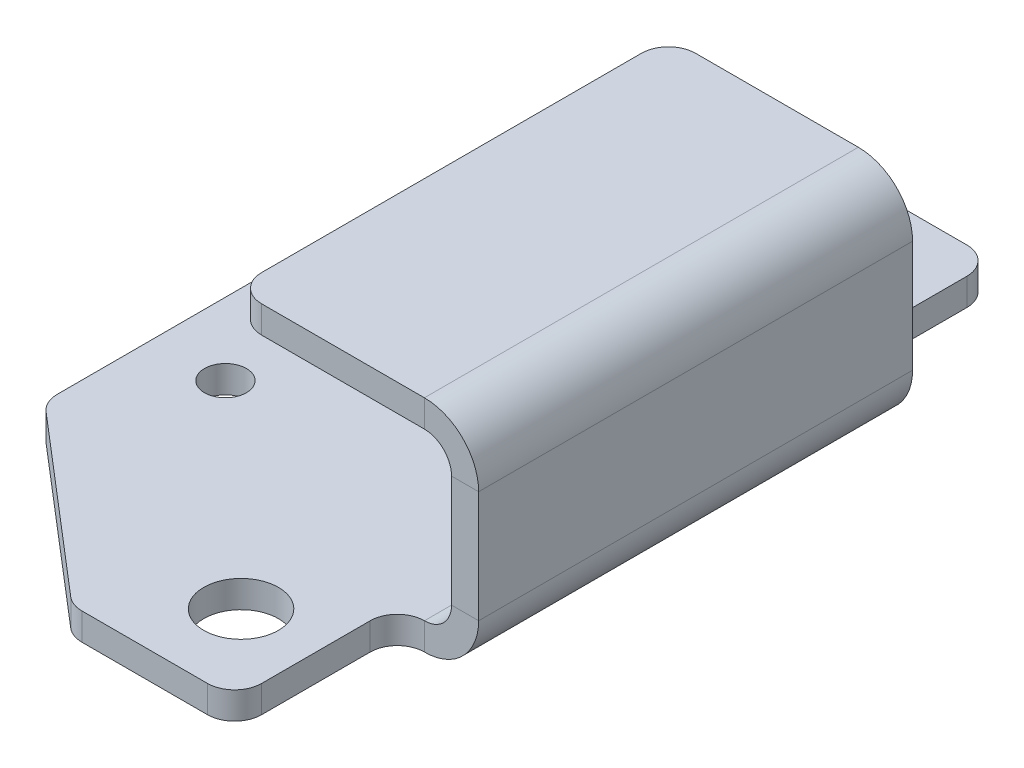
ISO-10303-21;
HEADER;
FILE_DESCRIPTION(('STEP AP214'),'2;1');
FILE_NAME('part.step','',(''),(''),'','','');
FILE_SCHEMA(('AUTOMOTIVE_DESIGN { 1 0 10303 214 1 1 1 1 }'));
ENDSEC;
DATA;
#1=APPLICATION_CONTEXT('core data for automotive mechanical design processes');
#2=APPLICATION_PROTOCOL_DEFINITION('international standard','automotive_design',2000,#1);
#3=PRODUCT_CONTEXT('',#1,'mechanical');
#4=PRODUCT('Part','Part','',(#3));
#5=PRODUCT_RELATED_PRODUCT_CATEGORY('part','',(#4));
#6=PRODUCT_DEFINITION_FORMATION('','',#4);
#7=PRODUCT_DEFINITION_CONTEXT('part definition',#1,'design');
#8=PRODUCT_DEFINITION('design','',#6,#7);
#9=PRODUCT_DEFINITION_SHAPE('','',#8);
#10=(LENGTH_UNIT() NAMED_UNIT(*) SI_UNIT(.MILLI.,.METRE.));
#11=(NAMED_UNIT(*) PLANE_ANGLE_UNIT() SI_UNIT($,.RADIAN.));
#12=(NAMED_UNIT(*) SI_UNIT($,.STERADIAN.) SOLID_ANGLE_UNIT());
#13=UNCERTAINTY_MEASURE_WITH_UNIT(LENGTH_MEASURE(1.E-05),#10,'distance_accuracy_value','');
#14=(GEOMETRIC_REPRESENTATION_CONTEXT(3) GLOBAL_UNCERTAINTY_ASSIGNED_CONTEXT((#13)) GLOBAL_UNIT_ASSIGNED_CONTEXT((#10,
#11,#12)) REPRESENTATION_CONTEXT('',''));
#15=CARTESIAN_POINT('',(0.,0.,0.));
#16=DIRECTION('',(0.,0.,1.));
#17=DIRECTION('',(1.,0.,0.));
#18=AXIS2_PLACEMENT_3D('',#15,#16,#17);
#19=CARTESIAN_POINT('',(25.4,-19.431,25.4));
#20=DIRECTION('',(0.,-1.,0.));
#21=DIRECTION('',(1.,0.,0.));
#22=AXIS2_PLACEMENT_3D('',#19,#20,#21);
#23=PLANE('',#22);
#24=CARTESIAN_POINT('',(-13.7668,-19.431,12.7));
#25=DIRECTION('',(0.,1.,0.));
#26=DIRECTION('',(-1.,0.,0.));
#27=AXIS2_PLACEMENT_3D('',#24,#25,#26);
#28=CIRCLE('',#27,2.45745);
#29=CARTESIAN_POINT('',(-16.22425,-19.431,12.7));
#30=VERTEX_POINT('',#29);
#31=EDGE_CURVE('E840',#30,#30,#28,.T.);
#32=ORIENTED_EDGE('',*,*,#31,.F.);
#33=EDGE_LOOP('',(#32));
#34=FACE_BOUND('',#33,.T.);
#35=CARTESIAN_POINT('',(-13.7668,-19.431,-12.7));
#36=DIRECTION('',(0.,1.,0.));
#37=DIRECTION('',(-1.,0.,0.));
#38=AXIS2_PLACEMENT_3D('',#35,#36,#37);
#39=CIRCLE('',#38,2.45745);
#40=CARTESIAN_POINT('',(-16.22425,-19.431,-12.7));
#41=VERTEX_POINT('',#40);
#42=EDGE_CURVE('E841',#41,#41,#39,.T.);
#43=ORIENTED_EDGE('',*,*,#42,.F.);
#44=EDGE_LOOP('',(#43));
#45=FACE_BOUND('',#44,.T.);
#46=CARTESIAN_POINT('',(10.287,-19.431,34.925));
#47=DIRECTION('',(0.,1.,0.));
#48=DIRECTION('',(-1.,0.,0.));
#49=AXIS2_PLACEMENT_3D('',#46,#47,#48);
#50=CIRCLE('',#49,4.36880000000001);
#51=CARTESIAN_POINT('',(5.9182,-19.431,34.925));
#52=VERTEX_POINT('',#51);
#53=EDGE_CURVE('E847',#52,#52,#50,.T.);
#54=ORIENTED_EDGE('',*,*,#53,.F.);
#55=EDGE_LOOP('',(#54));
#56=FACE_BOUND('',#55,.T.);
#57=CARTESIAN_POINT('',(10.287,-19.431,-34.925));
#58=DIRECTION('',(0.,1.,0.));
#59=DIRECTION('',(-1.,0.,0.));
#60=AXIS2_PLACEMENT_3D('',#57,#58,#59);
#61=CIRCLE('',#60,4.36879999999999);
#62=CARTESIAN_POINT('',(5.91820000000002,-19.431,-34.925));
#63=VERTEX_POINT('',#62);
#64=EDGE_CURVE('E853',#63,#63,#61,.T.);
#65=ORIENTED_EDGE('',*,*,#64,.F.);
#66=EDGE_LOOP('',(#65));
#67=FACE_BOUND('',#66,.T.);
#68=DIRECTION('',(0.759256602365297,0.,0.650791373455969));
#69=VECTOR('',#68,1.);
#70=CARTESIAN_POINT('',(-21.9635294117647,-19.431,25.6241176470588));
#71=LINE('',#70,#69);
#72=CARTESIAN_POINT('',(-21.1162626107227,-19.431,26.3503463336663));
#73=VERTEX_POINT('',#72);
#74=CARTESIAN_POINT('',(-0.891753668738532,-19.431,43.6856397125098));
#75=VERTEX_POINT('',#74);
#76=EDGE_CURVE('E833',#73,#75,#71,.T.);
#77=ORIENTED_EDGE('',*,*,#76,.T.);
#78=CARTESIAN_POINT('',(1.17450894198416,-19.431,41.275));
#79=DIRECTION('',(0.,-1.,0.));
#80=DIRECTION('',(1.,0.,0.));
#81=AXIS2_PLACEMENT_3D('',#78,#79,#80);
#82=CIRCLE('',#81,3.175);
#83=CARTESIAN_POINT('',(1.17450894198416,-19.431,44.45));
#84=VERTEX_POINT('',#83);
#85=EDGE_CURVE('E355',#75,#84,#82,.F.);
#86=ORIENTED_EDGE('',*,*,#85,.T.);
#87=DIRECTION('',(-1.,0.,0.));
#88=VECTOR('',#87,1.);
#89=CARTESIAN_POINT('',(-22.225,-19.431,44.45));
#90=LINE('',#89,#88);
#91=CARTESIAN_POINT('',(15.875,-19.431,44.45));
#92=VERTEX_POINT('',#91);
#93=EDGE_CURVE('E283',#92,#84,#90,.T.);
#94=ORIENTED_EDGE('',*,*,#93,.F.);
#95=CARTESIAN_POINT('',(15.875,-19.431,41.275));
#96=DIRECTION('',(0.,-1.,0.));
#97=DIRECTION('',(1.,0.,0.));
#98=AXIS2_PLACEMENT_3D('',#95,#96,#97);
#99=CIRCLE('',#98,3.175);
#100=CARTESIAN_POINT('',(19.05,-19.431,41.275));
#101=VERTEX_POINT('',#100);
#102=EDGE_CURVE('E345',#92,#101,#99,.F.);
#103=ORIENTED_EDGE('',*,*,#102,.T.);
#104=DIRECTION('',(0.,0.,1.));
#105=VECTOR('',#104,1.);
#106=CARTESIAN_POINT('',(19.05,-19.431,25.4));
#107=LINE('',#106,#105);
#108=CARTESIAN_POINT('',(19.05,-19.431,28.575));
#109=VERTEX_POINT('',#108);
#110=EDGE_CURVE('E863',#109,#101,#107,.T.);
#111=ORIENTED_EDGE('',*,*,#110,.F.);
#112=CARTESIAN_POINT('',(22.225,-19.431,28.575));
#113=DIRECTION('',(0.,-1.,0.));
#114=DIRECTION('',(1.,0.,0.));
#115=AXIS2_PLACEMENT_3D('',#112,#113,#114);
#116=CIRCLE('',#115,3.175);
#117=CARTESIAN_POINT('',(22.225,-19.431,25.4));
#118=VERTEX_POINT('',#117);
#119=EDGE_CURVE('E11',#109,#118,#116,.T.);
#120=ORIENTED_EDGE('',*,*,#119,.T.);
#121=DIRECTION('',(0.,0.,-1.));
#122=VECTOR('',#121,1.);
#123=CARTESIAN_POINT('',(22.225,-19.431,25.4));
#124=LINE('',#123,#122);
#125=CARTESIAN_POINT('',(22.225,-19.431,-25.4));
#126=VERTEX_POINT('',#125);
#127=EDGE_CURVE('E279',#118,#126,#124,.T.);
#128=ORIENTED_EDGE('',*,*,#127,.T.);
#129=CARTESIAN_POINT('',(22.225,-19.431,-28.575));
#130=DIRECTION('',(0.,-1.,0.));
#131=DIRECTION('',(1.,0.,0.));
#132=AXIS2_PLACEMENT_3D('',#129,#130,#131);
#133=CIRCLE('',#132,3.175);
#134=CARTESIAN_POINT('',(19.05,-19.431,-28.575));
#135=VERTEX_POINT('',#134);
#136=EDGE_CURVE('E225',#126,#135,#133,.T.);
#137=ORIENTED_EDGE('',*,*,#136,.T.);
#138=DIRECTION('',(0.,0.,1.));
#139=VECTOR('',#138,1.);
#140=CARTESIAN_POINT('',(19.05,-19.431,-25.4));
#141=LINE('',#140,#139);
#142=CARTESIAN_POINT('',(19.05,-19.431,-41.275));
#143=VERTEX_POINT('',#142);
#144=EDGE_CURVE('E420',#143,#135,#141,.T.);
#145=ORIENTED_EDGE('',*,*,#144,.F.);
#146=CARTESIAN_POINT('',(15.875,-19.431,-41.275));
#147=DIRECTION('',(0.,-1.,0.));
#148=DIRECTION('',(1.,0.,0.));
#149=AXIS2_PLACEMENT_3D('',#146,#147,#148);
#150=CIRCLE('',#149,3.175);
#151=CARTESIAN_POINT('',(15.875,-19.431,-44.45));
#152=VERTEX_POINT('',#151);
#153=EDGE_CURVE('E347',#143,#152,#150,.F.);
#154=ORIENTED_EDGE('',*,*,#153,.T.);
#155=DIRECTION('',(1.,0.,0.));
#156=VECTOR('',#155,1.);
#157=CARTESIAN_POINT('',(-22.225,-19.431,-44.45));
#158=LINE('',#157,#156);
#159=CARTESIAN_POINT('',(1.17450894198416,-19.431,-44.45));
#160=VERTEX_POINT('',#159);
#161=EDGE_CURVE('E429',#160,#152,#158,.T.);
#162=ORIENTED_EDGE('',*,*,#161,.F.);
#163=CARTESIAN_POINT('',(1.17450894198416,-19.431,-41.275));
#164=DIRECTION('',(0.,-1.,0.));
#165=DIRECTION('',(1.,0.,0.));
#166=AXIS2_PLACEMENT_3D('',#163,#164,#165);
#167=CIRCLE('',#166,3.175);
#168=CARTESIAN_POINT('',(-0.891753668738532,-19.431,-43.6856397125098));
#169=VERTEX_POINT('',#168);
#170=EDGE_CURVE('E351',#160,#169,#167,.F.);
#171=ORIENTED_EDGE('',*,*,#170,.T.);
#172=DIRECTION('',(0.759256602365297,0.,-0.650791373455969));
#173=VECTOR('',#172,1.);
#174=CARTESIAN_POINT('',(-21.9635294117647,-19.431,-25.6241176470588));
#175=LINE('',#174,#173);
#176=CARTESIAN_POINT('',(-21.1162626107227,-19.431,-26.3503463336663));
#177=VERTEX_POINT('',#176);
#178=EDGE_CURVE('E827',#177,#169,#175,.T.);
#179=ORIENTED_EDGE('',*,*,#178,.F.);
#180=CARTESIAN_POINT('',(-19.05,-19.431,-23.9397066211564));
#181=DIRECTION('',(0.,-1.,0.));
#182=DIRECTION('',(1.,0.,0.));
#183=AXIS2_PLACEMENT_3D('',#180,#181,#182);
#184=CIRCLE('',#183,3.175);
#185=CARTESIAN_POINT('',(-22.225,-19.431,-23.9397066211564));
#186=VERTEX_POINT('',#185);
#187=EDGE_CURVE('E349',#177,#186,#184,.F.);
#188=ORIENTED_EDGE('',*,*,#187,.T.);
#189=DIRECTION('',(0.,0.,-1.));
#190=VECTOR('',#189,1.);
#191=CARTESIAN_POINT('',(-22.225,-19.431,25.4));
#192=LINE('',#191,#190);
#193=CARTESIAN_POINT('',(-22.225,-19.431,23.9397066211564));
#194=VERTEX_POINT('',#193);
#195=EDGE_CURVE('E322',#194,#186,#192,.T.);
#196=ORIENTED_EDGE('',*,*,#195,.F.);
#197=CARTESIAN_POINT('',(-19.05,-19.431,23.9397066211564));
#198=DIRECTION('',(0.,-1.,0.));
#199=DIRECTION('',(1.,0.,0.));
#200=AXIS2_PLACEMENT_3D('',#197,#198,#199);
#201=CIRCLE('',#200,3.175);
#202=EDGE_CURVE('E353',#194,#73,#201,.F.);
#203=ORIENTED_EDGE('',*,*,#202,.T.);
#204=EDGE_LOOP('',(#77,#86,#94,#103,#111,#120,#128,#137,#145,#154,#162,#171,#179,#188,#196,#203));
#205=FACE_BOUND('',#204,.T.);
#206=ADVANCED_FACE('F41',(#34,#45,#56,#67,#205),#23,.F.);
#207=CARTESIAN_POINT('',(-22.225,-22.606,25.4));
#208=DIRECTION('',(-1.,0.,0.));
#209=DIRECTION('',(0.,0.,1.));
#210=AXIS2_PLACEMENT_3D('',#207,#208,#209);
#211=PLANE('',#210);
#212=DIRECTION('',(0.,0.,-1.));
#213=VECTOR('',#212,1.);
#214=CARTESIAN_POINT('',(-22.225,-22.606,25.4));
#215=LINE('',#214,#213);
#216=CARTESIAN_POINT('',(-22.225,-22.606,23.9397066211564));
#217=VERTEX_POINT('',#216);
#218=CARTESIAN_POINT('',(-22.225,-22.606,-23.9397066211564));
#219=VERTEX_POINT('',#218);
#220=EDGE_CURVE('E248',#217,#219,#215,.T.);
#221=ORIENTED_EDGE('',*,*,#220,.F.);
#222=DIRECTION('',(0.,1.,0.));
#223=VECTOR('',#222,1.);
#224=CARTESIAN_POINT('',(-22.225,-22.606,23.9397066211564));
#225=LINE('',#224,#223);
#226=EDGE_CURVE('E375',#217,#194,#225,.T.);
#227=ORIENTED_EDGE('',*,*,#226,.T.);
#228=ORIENTED_EDGE('',*,*,#195,.T.);
#229=DIRECTION('',(0.,1.,0.));
#230=VECTOR('',#229,1.);
#231=CARTESIAN_POINT('',(-22.225,-22.606,-23.9397066211564));
#232=LINE('',#231,#230);
#233=EDGE_CURVE('E373',#186,#219,#232,.F.);
#234=ORIENTED_EDGE('',*,*,#233,.T.);
#235=EDGE_LOOP('',(#221,#227,#228,#234));
#236=FACE_BOUND('',#235,.T.);
#237=ADVANCED_FACE('F497',(#236),#211,.T.);
#238=CARTESIAN_POINT('',(25.4,-22.606,25.4));
#239=DIRECTION('',(0.,-1.,0.));
#240=DIRECTION('',(1.,0.,0.));
#241=AXIS2_PLACEMENT_3D('',#238,#239,#240);
#242=PLANE('',#241);
#243=CARTESIAN_POINT('',(10.287,-22.606,-34.925));
#244=DIRECTION('',(0.,1.,0.));
#245=DIRECTION('',(-1.,0.,0.));
#246=AXIS2_PLACEMENT_3D('',#243,#244,#245);
#247=CIRCLE('',#246,4.36879999999999);
#248=CARTESIAN_POINT('',(5.91820000000002,-22.606,-34.925));
#249=VERTEX_POINT('',#248);
#250=EDGE_CURVE('E850',#249,#249,#247,.T.);
#251=ORIENTED_EDGE('',*,*,#250,.T.);
#252=EDGE_LOOP('',(#251));
#253=FACE_BOUND('',#252,.T.);
#254=CARTESIAN_POINT('',(10.287,-22.606,34.925));
#255=DIRECTION('',(0.,1.,0.));
#256=DIRECTION('',(-1.,0.,0.));
#257=AXIS2_PLACEMENT_3D('',#254,#255,#256);
#258=CIRCLE('',#257,4.36880000000001);
#259=CARTESIAN_POINT('',(5.9182,-22.606,34.925));
#260=VERTEX_POINT('',#259);
#261=EDGE_CURVE('E844',#260,#260,#258,.T.);
#262=ORIENTED_EDGE('',*,*,#261,.T.);
#263=EDGE_LOOP('',(#262));
#264=FACE_BOUND('',#263,.T.);
#265=CARTESIAN_POINT('',(-13.7668,-22.606,-12.7));
#266=DIRECTION('',(0.,1.,0.));
#267=DIRECTION('',(-1.,0.,0.));
#268=AXIS2_PLACEMENT_3D('',#265,#266,#267);
#269=CIRCLE('',#268,2.45745);
#270=CARTESIAN_POINT('',(-16.22425,-22.606,-12.7));
#271=VERTEX_POINT('',#270);
#272=EDGE_CURVE('E837',#271,#271,#269,.T.);
#273=ORIENTED_EDGE('',*,*,#272,.T.);
#274=EDGE_LOOP('',(#273));
#275=FACE_BOUND('',#274,.T.);
#276=CARTESIAN_POINT('',(-13.7668,-22.606,12.7));
#277=DIRECTION('',(0.,1.,0.));
#278=DIRECTION('',(-1.,0.,0.));
#279=AXIS2_PLACEMENT_3D('',#276,#277,#278);
#280=CIRCLE('',#279,2.45745);
#281=CARTESIAN_POINT('',(-16.22425,-22.606,12.7));
#282=VERTEX_POINT('',#281);
#283=EDGE_CURVE('E821',#282,#282,#280,.T.);
#284=ORIENTED_EDGE('',*,*,#283,.T.);
#285=EDGE_LOOP('',(#284));
#286=FACE_BOUND('',#285,.T.);
#287=DIRECTION('',(-1.,0.,0.));
#288=VECTOR('',#287,1.);
#289=CARTESIAN_POINT('',(-22.225,-22.606,44.45));
#290=LINE('',#289,#288);
#291=CARTESIAN_POINT('',(15.875,-22.606,44.45));
#292=VERTEX_POINT('',#291);
#293=CARTESIAN_POINT('',(1.17450894198416,-22.606,44.45));
#294=VERTEX_POINT('',#293);
#295=EDGE_CURVE('E263',#292,#294,#290,.T.);
#296=ORIENTED_EDGE('',*,*,#295,.T.);
#297=CARTESIAN_POINT('',(1.17450894198416,-22.606,41.275));
#298=DIRECTION('',(0.,-1.,0.));
#299=DIRECTION('',(1.,0.,0.));
#300=AXIS2_PLACEMENT_3D('',#297,#298,#299);
#301=CIRCLE('',#300,3.175);
#302=CARTESIAN_POINT('',(-0.891753668738532,-22.606,43.6856397125098));
#303=VERTEX_POINT('',#302);
#304=EDGE_CURVE('E371',#294,#303,#301,.T.);
#305=ORIENTED_EDGE('',*,*,#304,.T.);
#306=DIRECTION('',(0.759256602365297,0.,0.650791373455969));
#307=VECTOR('',#306,1.);
#308=CARTESIAN_POINT('',(-21.9635294117647,-22.606,25.6241176470588));
#309=LINE('',#308,#307);
#310=CARTESIAN_POINT('',(-21.1162626107227,-22.606,26.3503463336663));
#311=VERTEX_POINT('',#310);
#312=EDGE_CURVE('E856',#311,#303,#309,.T.);
#313=ORIENTED_EDGE('',*,*,#312,.F.);
#314=CARTESIAN_POINT('',(-19.05,-22.606,23.9397066211564));
#315=DIRECTION('',(0.,-1.,0.));
#316=DIRECTION('',(1.,0.,0.));
#317=AXIS2_PLACEMENT_3D('',#314,#315,#316);
#318=CIRCLE('',#317,3.175);
#319=EDGE_CURVE('E369',#311,#217,#318,.T.);
#320=ORIENTED_EDGE('',*,*,#319,.T.);
#321=ORIENTED_EDGE('',*,*,#220,.T.);
#322=CARTESIAN_POINT('',(-19.05,-22.606,-23.9397066211564));
#323=DIRECTION('',(0.,-1.,0.));
#324=DIRECTION('',(1.,0.,0.));
#325=AXIS2_PLACEMENT_3D('',#322,#323,#324);
#326=CIRCLE('',#325,3.175);
#327=CARTESIAN_POINT('',(-21.1162626107227,-22.606,-26.3503463336663));
#328=VERTEX_POINT('',#327);
#329=EDGE_CURVE('E365',#219,#328,#326,.T.);
#330=ORIENTED_EDGE('',*,*,#329,.T.);
#331=DIRECTION('',(0.759256602365297,0.,-0.650791373455969));
#332=VECTOR('',#331,1.);
#333=CARTESIAN_POINT('',(-21.9635294117647,-22.606,-25.6241176470588));
#334=LINE('',#333,#332);
#335=CARTESIAN_POINT('',(-0.891753668738532,-22.606,-43.6856397125098));
#336=VERTEX_POINT('',#335);
#337=EDGE_CURVE('E831',#328,#336,#334,.T.);
#338=ORIENTED_EDGE('',*,*,#337,.T.);
#339=CARTESIAN_POINT('',(1.17450894198416,-22.606,-41.275));
#340=DIRECTION('',(0.,-1.,0.));
#341=DIRECTION('',(1.,0.,0.));
#342=AXIS2_PLACEMENT_3D('',#339,#340,#341);
#343=CIRCLE('',#342,3.175);
#344=CARTESIAN_POINT('',(1.17450894198416,-22.606,-44.45));
#345=VERTEX_POINT('',#344);
#346=EDGE_CURVE('E367',#336,#345,#343,.T.);
#347=ORIENTED_EDGE('',*,*,#346,.T.);
#348=DIRECTION('',(1.,0.,0.));
#349=VECTOR('',#348,1.);
#350=CARTESIAN_POINT('',(-22.225,-22.606,-44.45));
#351=LINE('',#350,#349);
#352=CARTESIAN_POINT('',(15.875,-22.606,-44.45));
#353=VERTEX_POINT('',#352);
#354=EDGE_CURVE('E815',#345,#353,#351,.T.);
#355=ORIENTED_EDGE('',*,*,#354,.T.);
#356=CARTESIAN_POINT('',(15.875,-22.606,-41.275));
#357=DIRECTION('',(0.,-1.,0.));
#358=DIRECTION('',(1.,0.,0.));
#359=AXIS2_PLACEMENT_3D('',#356,#357,#358);
#360=CIRCLE('',#359,3.175);
#361=CARTESIAN_POINT('',(19.05,-22.606,-41.275));
#362=VERTEX_POINT('',#361);
#363=EDGE_CURVE('E363',#353,#362,#360,.T.);
#364=ORIENTED_EDGE('',*,*,#363,.T.);
#365=DIRECTION('',(0.,0.,1.));
#366=VECTOR('',#365,1.);
#367=CARTESIAN_POINT('',(19.05,-22.606,-25.4));
#368=LINE('',#367,#366);
#369=CARTESIAN_POINT('',(19.05,-22.606,-28.575));
#370=VERTEX_POINT('',#369);
#371=EDGE_CURVE('E820',#362,#370,#368,.T.);
#372=ORIENTED_EDGE('',*,*,#371,.T.);
#373=CARTESIAN_POINT('',(22.225,-22.606,-28.575));
#374=DIRECTION('',(0.,-1.,0.));
#375=DIRECTION('',(1.,0.,0.));
#376=AXIS2_PLACEMENT_3D('',#373,#374,#375);
#377=CIRCLE('',#376,3.175);
#378=CARTESIAN_POINT('',(22.225,-22.606,-25.4));
#379=VERTEX_POINT('',#378);
#380=EDGE_CURVE('E244',#370,#379,#377,.F.);
#381=ORIENTED_EDGE('',*,*,#380,.T.);
#382=DIRECTION('',(0.,0.,-1.));
#383=VECTOR('',#382,1.);
#384=CARTESIAN_POINT('',(22.225,-22.606,25.4));
#385=LINE('',#384,#383);
#386=CARTESIAN_POINT('',(22.225,-22.606,25.4));
#387=VERTEX_POINT('',#386);
#388=EDGE_CURVE('E240',#387,#379,#385,.T.);
#389=ORIENTED_EDGE('',*,*,#388,.F.);
#390=CARTESIAN_POINT('',(22.225,-22.606,28.575));
#391=DIRECTION('',(0.,-1.,0.));
#392=DIRECTION('',(1.,0.,0.));
#393=AXIS2_PLACEMENT_3D('',#390,#391,#392);
#394=CIRCLE('',#393,3.175);
#395=CARTESIAN_POINT('',(19.05,-22.606,28.575));
#396=VERTEX_POINT('',#395);
#397=EDGE_CURVE('E49',#387,#396,#394,.F.);
#398=ORIENTED_EDGE('',*,*,#397,.T.);
#399=DIRECTION('',(0.,0.,1.));
#400=VECTOR('',#399,1.);
#401=CARTESIAN_POINT('',(19.05,-22.606,25.4));
#402=LINE('',#401,#400);
#403=CARTESIAN_POINT('',(19.05,-22.606,41.275));
#404=VERTEX_POINT('',#403);
#405=EDGE_CURVE('E428',#396,#404,#402,.T.);
#406=ORIENTED_EDGE('',*,*,#405,.T.);
#407=CARTESIAN_POINT('',(15.875,-22.606,41.275));
#408=DIRECTION('',(0.,-1.,0.));
#409=DIRECTION('',(1.,0.,0.));
#410=AXIS2_PLACEMENT_3D('',#407,#408,#409);
#411=CIRCLE('',#410,3.175);
#412=EDGE_CURVE('E361',#404,#292,#411,.T.);
#413=ORIENTED_EDGE('',*,*,#412,.T.);
#414=EDGE_LOOP('',(#296,#305,#313,#320,#321,#330,#338,#347,#355,#364,#372,#381,#389,#398,#406,#413));
#415=FACE_BOUND('',#414,.T.);
#416=ADVANCED_FACE('F242',(#253,#264,#275,#286,#415),#242,.T.);
#417=CARTESIAN_POINT('',(-22.225,-19.431,44.45));
#418=DIRECTION('',(0.,0.,1.));
#419=DIRECTION('',(1.,0.,0.));
#420=AXIS2_PLACEMENT_3D('',#417,#418,#419);
#421=PLANE('',#420);
#422=ORIENTED_EDGE('',*,*,#93,.T.);
#423=DIRECTION('',(0.,1.,0.));
#424=VECTOR('',#423,1.);
#425=CARTESIAN_POINT('',(1.17450894198416,-19.431,44.45));
#426=LINE('',#425,#424);
#427=EDGE_CURVE('E359',#84,#294,#426,.F.);
#428=ORIENTED_EDGE('',*,*,#427,.T.);
#429=ORIENTED_EDGE('',*,*,#295,.F.);
#430=DIRECTION('',(0.,-1.,0.));
#431=VECTOR('',#430,1.);
#432=CARTESIAN_POINT('',(15.875,-19.431,44.45));
#433=LINE('',#432,#431);
#434=EDGE_CURVE('E357',#292,#92,#433,.F.);
#435=ORIENTED_EDGE('',*,*,#434,.T.);
#436=EDGE_LOOP('',(#422,#428,#429,#435));
#437=FACE_BOUND('',#436,.T.);
#438=ADVANCED_FACE('F524',(#437),#421,.T.);
#439=CARTESIAN_POINT('',(22.225,0.,25.4));
#440=DIRECTION('',(0.,0.,1.));
#441=DIRECTION('',(1.,0.,0.));
#442=AXIS2_PLACEMENT_3D('',#439,#440,#441);
#443=PLANE('',#442);
#444=DIRECTION('',(0.,1.,0.));
#445=VECTOR('',#444,1.);
#446=CARTESIAN_POINT('',(22.225,0.,25.4));
#447=LINE('',#446,#445);
#448=CARTESIAN_POINT('',(22.225,0.,25.4));
#449=VERTEX_POINT('',#448);
#450=CARTESIAN_POINT('',(22.225,3.175,25.4));
#451=VERTEX_POINT('',#450);
#452=EDGE_CURVE('E337',#449,#451,#447,.T.);
#453=ORIENTED_EDGE('',*,*,#452,.F.);
#454=CARTESIAN_POINT('',(22.225,-3.175,25.4));
#455=DIRECTION('',(0.,0.,1.));
#456=DIRECTION('',(1.,0.,0.));
#457=AXIS2_PLACEMENT_3D('',#454,#455,#456);
#458=CIRCLE('',#457,3.175);
#459=CARTESIAN_POINT('',(25.4,-3.175,25.4));
#460=VERTEX_POINT('',#459);
#461=EDGE_CURVE('E272',#449,#460,#458,.F.);
#462=ORIENTED_EDGE('',*,*,#461,.T.);
#463=DIRECTION('',(-1.,0.,0.));
#464=VECTOR('',#463,1.);
#465=CARTESIAN_POINT('',(28.575,-3.175,25.4));
#466=LINE('',#465,#464);
#467=CARTESIAN_POINT('',(28.575,-3.175,25.4));
#468=VERTEX_POINT('',#467);
#469=EDGE_CURVE('E335',#468,#460,#466,.T.);
#470=ORIENTED_EDGE('',*,*,#469,.F.);
#471=CARTESIAN_POINT('',(22.225,-3.175,25.4));
#472=DIRECTION('',(0.,0.,1.));
#473=DIRECTION('',(1.,0.,0.));
#474=AXIS2_PLACEMENT_3D('',#471,#472,#473);
#475=CIRCLE('',#474,6.35);
#476=EDGE_CURVE('E257',#451,#468,#475,.F.);
#477=ORIENTED_EDGE('',*,*,#476,.F.);
#478=EDGE_LOOP('',(#453,#462,#470,#477));
#479=FACE_BOUND('',#478,.T.);
#480=ADVANCED_FACE('F459',(#479),#443,.T.);
#481=CARTESIAN_POINT('',(28.575,-3.175,25.4));
#482=DIRECTION('',(0.,0.,1.));
#483=DIRECTION('',(1.,0.,0.));
#484=AXIS2_PLACEMENT_3D('',#481,#482,#483);
#485=PLANE('',#484);
#486=DIRECTION('',(1.,0.,0.));
#487=VECTOR('',#486,1.);
#488=CARTESIAN_POINT('',(0.,3.175,25.4));
#489=LINE('',#488,#487);
#490=CARTESIAN_POINT('',(3.175,3.175,25.4));
#491=VERTEX_POINT('',#490);
#492=EDGE_CURVE('E268',#491,#451,#489,.T.);
#493=ORIENTED_EDGE('',*,*,#492,.F.);
#494=DIRECTION('',(0.,1.,0.));
#495=VECTOR('',#494,1.);
#496=CARTESIAN_POINT('',(3.175,-3.175,25.4));
#497=LINE('',#496,#495);
#498=CARTESIAN_POINT('',(3.175,0.,25.4));
#499=VERTEX_POINT('',#498);
#500=EDGE_CURVE('E56',#491,#499,#497,.F.);
#501=ORIENTED_EDGE('',*,*,#500,.T.);
#502=DIRECTION('',(1.,0.,0.));
#503=VECTOR('',#502,1.);
#504=CARTESIAN_POINT('',(0.,0.,25.4));
#505=LINE('',#504,#503);
#506=EDGE_CURVE('E270',#499,#449,#505,.T.);
#507=ORIENTED_EDGE('',*,*,#506,.T.);
#508=ORIENTED_EDGE('',*,*,#452,.T.);
#509=EDGE_LOOP('',(#493,#501,#507,#508));
#510=FACE_BOUND('',#509,.T.);
#511=ADVANCED_FACE('F474',(#510),#485,.T.);
#512=CARTESIAN_POINT('',(25.4,-3.175,-25.4));
#513=DIRECTION('',(0.,0.,-1.));
#514=DIRECTION('',(-1.,0.,0.));
#515=AXIS2_PLACEMENT_3D('',#512,#513,#514);
#516=PLANE('',#515);
#517=DIRECTION('',(1.,0.,0.));
#518=VECTOR('',#517,1.);
#519=CARTESIAN_POINT('',(25.4,-3.175,-25.4));
#520=LINE('',#519,#518);
#521=CARTESIAN_POINT('',(25.4,-3.175,-25.4));
#522=VERTEX_POINT('',#521);
#523=CARTESIAN_POINT('',(28.575,-3.175,-25.4));
#524=VERTEX_POINT('',#523);
#525=EDGE_CURVE('E333',#522,#524,#520,.T.);
#526=ORIENTED_EDGE('',*,*,#525,.F.);
#527=CARTESIAN_POINT('',(22.225,-3.175,-25.4));
#528=DIRECTION('',(0.,0.,1.));
#529=DIRECTION('',(1.,0.,0.));
#530=AXIS2_PLACEMENT_3D('',#527,#528,#529);
#531=CIRCLE('',#530,3.175);
#532=CARTESIAN_POINT('',(22.225,0.,-25.4));
#533=VERTEX_POINT('',#532);
#534=EDGE_CURVE('E293',#533,#522,#531,.F.);
#535=ORIENTED_EDGE('',*,*,#534,.F.);
#536=DIRECTION('',(0.,-1.,0.));
#537=VECTOR('',#536,1.);
#538=CARTESIAN_POINT('',(22.225,3.175,-25.4));
#539=LINE('',#538,#537);
#540=CARTESIAN_POINT('',(22.225,3.175,-25.4));
#541=VERTEX_POINT('',#540);
#542=EDGE_CURVE('E330',#541,#533,#539,.T.);
#543=ORIENTED_EDGE('',*,*,#542,.F.);
#544=CARTESIAN_POINT('',(22.225,-3.175,-25.4));
#545=DIRECTION('',(0.,0.,1.));
#546=DIRECTION('',(1.,0.,0.));
#547=AXIS2_PLACEMENT_3D('',#544,#545,#546);
#548=CIRCLE('',#547,6.35);
#549=EDGE_CURVE('E286',#541,#524,#548,.F.);
#550=ORIENTED_EDGE('',*,*,#549,.T.);
#551=EDGE_LOOP('',(#526,#535,#543,#550));
#552=FACE_BOUND('',#551,.T.);
#553=ADVANCED_FACE('F467',(#552),#516,.T.);
#554=CARTESIAN_POINT('',(22.225,3.175,-25.4));
#555=DIRECTION('',(0.,0.,-1.));
#556=DIRECTION('',(-1.,0.,0.));
#557=AXIS2_PLACEMENT_3D('',#554,#555,#556);
#558=PLANE('',#557);
#559=DIRECTION('',(0.,-1.,0.));
#560=VECTOR('',#559,1.);
#561=CARTESIAN_POINT('',(25.4,0.,-25.4));
#562=LINE('',#561,#560);
#563=CARTESIAN_POINT('',(25.4,-16.256,-25.4));
#564=VERTEX_POINT('',#563);
#565=EDGE_CURVE('E260',#522,#564,#562,.T.);
#566=ORIENTED_EDGE('',*,*,#565,.F.);
#567=ORIENTED_EDGE('',*,*,#525,.T.);
#568=DIRECTION('',(0.,-1.,0.));
#569=VECTOR('',#568,1.);
#570=CARTESIAN_POINT('',(28.575,0.,-25.4));
#571=LINE('',#570,#569);
#572=CARTESIAN_POINT('',(28.575,-16.256,-25.4));
#573=VERTEX_POINT('',#572);
#574=EDGE_CURVE('E282',#524,#573,#571,.T.);
#575=ORIENTED_EDGE('',*,*,#574,.T.);
#576=DIRECTION('',(-1.,0.,0.));
#577=VECTOR('',#576,1.);
#578=CARTESIAN_POINT('',(28.575,-16.256,-25.4));
#579=LINE('',#578,#577);
#580=EDGE_CURVE('E325',#573,#564,#579,.T.);
#581=ORIENTED_EDGE('',*,*,#580,.T.);
#582=EDGE_LOOP('',(#566,#567,#575,#581));
#583=FACE_BOUND('',#582,.T.);
#584=ADVANCED_FACE('F444',(#583),#558,.T.);
#585=CARTESIAN_POINT('',(25.4,-16.256,25.4));
#586=DIRECTION('',(0.,0.,1.));
#587=DIRECTION('',(1.,0.,0.));
#588=AXIS2_PLACEMENT_3D('',#585,#586,#587);
#589=PLANE('',#588);
#590=DIRECTION('',(1.,0.,0.));
#591=VECTOR('',#590,1.);
#592=CARTESIAN_POINT('',(25.4,-16.256,25.4));
#593=LINE('',#592,#591);
#594=CARTESIAN_POINT('',(25.4,-16.256,25.4));
#595=VERTEX_POINT('',#594);
#596=CARTESIAN_POINT('',(28.575,-16.256,25.4));
#597=VERTEX_POINT('',#596);
#598=EDGE_CURVE('E236',#595,#597,#593,.T.);
#599=ORIENTED_EDGE('',*,*,#598,.F.);
#600=CARTESIAN_POINT('',(22.225,-16.256,25.4));
#601=DIRECTION('',(0.,0.,1.));
#602=DIRECTION('',(1.,0.,0.));
#603=AXIS2_PLACEMENT_3D('',#600,#601,#602);
#604=CIRCLE('',#603,3.175);
#605=EDGE_CURVE('E234',#595,#118,#604,.F.);
#606=ORIENTED_EDGE('',*,*,#605,.T.);
#607=DIRECTION('',(0.,1.,0.));
#608=VECTOR('',#607,1.);
#609=CARTESIAN_POINT('',(22.225,-22.606,25.4));
#610=LINE('',#609,#608);
#611=EDGE_CURVE('E219',#387,#118,#610,.T.);
#612=ORIENTED_EDGE('',*,*,#611,.F.);
#613=CARTESIAN_POINT('',(22.225,-16.256,25.4));
#614=DIRECTION('',(0.,0.,1.));
#615=DIRECTION('',(1.,0.,0.));
#616=AXIS2_PLACEMENT_3D('',#613,#614,#615);
#617=CIRCLE('',#616,6.35);
#618=EDGE_CURVE('E231',#597,#387,#617,.F.);
#619=ORIENTED_EDGE('',*,*,#618,.F.);
#620=EDGE_LOOP('',(#599,#606,#612,#619));
#621=FACE_BOUND('',#620,.T.);
#622=ADVANCED_FACE('F229',(#621),#589,.T.);
#623=CARTESIAN_POINT('',(22.225,-22.606,25.4));
#624=DIRECTION('',(0.,0.,1.));
#625=DIRECTION('',(1.,0.,0.));
#626=AXIS2_PLACEMENT_3D('',#623,#624,#625);
#627=PLANE('',#626);
#628=DIRECTION('',(0.,-1.,0.));
#629=VECTOR('',#628,1.);
#630=CARTESIAN_POINT('',(25.4,0.,25.4));
#631=LINE('',#630,#629);
#632=EDGE_CURVE('E275',#460,#595,#631,.T.);
#633=ORIENTED_EDGE('',*,*,#632,.T.);
#634=ORIENTED_EDGE('',*,*,#598,.T.);
#635=DIRECTION('',(0.,-1.,0.));
#636=VECTOR('',#635,1.);
#637=CARTESIAN_POINT('',(28.575,0.,25.4));
#638=LINE('',#637,#636);
#639=EDGE_CURVE('E254',#468,#597,#638,.T.);
#640=ORIENTED_EDGE('',*,*,#639,.F.);
#641=ORIENTED_EDGE('',*,*,#469,.T.);
#642=EDGE_LOOP('',(#633,#634,#640,#641));
#643=FACE_BOUND('',#642,.T.);
#644=ADVANCED_FACE('F451',(#643),#627,.T.);
#645=CARTESIAN_POINT('',(22.225,-19.431,-25.4));
#646=DIRECTION('',(0.,0.,-1.));
#647=DIRECTION('',(-1.,0.,0.));
#648=AXIS2_PLACEMENT_3D('',#645,#646,#647);
#649=PLANE('',#648);
#650=DIRECTION('',(0.,-1.,0.));
#651=VECTOR('',#650,1.);
#652=CARTESIAN_POINT('',(22.225,-19.431,-25.4));
#653=LINE('',#652,#651);
#654=EDGE_CURVE('E237',#126,#379,#653,.T.);
#655=ORIENTED_EDGE('',*,*,#654,.F.);
#656=CARTESIAN_POINT('',(22.225,-16.256,-25.4));
#657=DIRECTION('',(0.,0.,1.));
#658=DIRECTION('',(1.,0.,0.));
#659=AXIS2_PLACEMENT_3D('',#656,#657,#658);
#660=CIRCLE('',#659,3.175);
#661=EDGE_CURVE('E255',#564,#126,#660,.F.);
#662=ORIENTED_EDGE('',*,*,#661,.F.);
#663=ORIENTED_EDGE('',*,*,#580,.F.);
#664=CARTESIAN_POINT('',(22.225,-16.256,-25.4));
#665=DIRECTION('',(0.,0.,1.));
#666=DIRECTION('',(1.,0.,0.));
#667=AXIS2_PLACEMENT_3D('',#664,#665,#666);
#668=CIRCLE('',#667,6.35);
#669=EDGE_CURVE('E280',#573,#379,#668,.F.);
#670=ORIENTED_EDGE('',*,*,#669,.T.);
#671=EDGE_LOOP('',(#655,#662,#663,#670));
#672=FACE_BOUND('',#671,.T.);
#673=ADVANCED_FACE('F434',(#672),#649,.T.);
#674=CARTESIAN_POINT('',(22.225,-16.256,25.4));
#675=DIRECTION('',(0.,0.,-1.));
#676=DIRECTION('',(-1.,0.,0.));
#677=AXIS2_PLACEMENT_3D('',#674,#675,#676);
#678=CYLINDRICAL_SURFACE('',#677,6.35);
#679=ORIENTED_EDGE('',*,*,#669,.F.);
#680=DIRECTION('',(0.,0.,-1.));
#681=VECTOR('',#680,1.);
#682=CARTESIAN_POINT('',(28.575,-16.256,25.4));
#683=LINE('',#682,#681);
#684=EDGE_CURVE('E249',#597,#573,#683,.T.);
#685=ORIENTED_EDGE('',*,*,#684,.F.);
#686=ORIENTED_EDGE('',*,*,#618,.T.);
#687=ORIENTED_EDGE('',*,*,#388,.T.);
#688=EDGE_LOOP('',(#679,#685,#686,#687));
#689=FACE_BOUND('',#688,.T.);
#690=ADVANCED_FACE('F252',(#689),#678,.T.);
#691=CARTESIAN_POINT('',(28.575,0.,25.4));
#692=DIRECTION('',(1.,0.,0.));
#693=DIRECTION('',(0.,1.,0.));
#694=AXIS2_PLACEMENT_3D('',#691,#692,#693);
#695=PLANE('',#694);
#696=ORIENTED_EDGE('',*,*,#574,.F.);
#697=DIRECTION('',(0.,0.,-1.));
#698=VECTOR('',#697,1.);
#699=CARTESIAN_POINT('',(28.575,-3.175,25.4));
#700=LINE('',#699,#698);
#701=EDGE_CURVE('E316',#468,#524,#700,.T.);
#702=ORIENTED_EDGE('',*,*,#701,.F.);
#703=ORIENTED_EDGE('',*,*,#639,.T.);
#704=ORIENTED_EDGE('',*,*,#684,.T.);
#705=EDGE_LOOP('',(#696,#702,#703,#704));
#706=FACE_BOUND('',#705,.T.);
#707=ADVANCED_FACE('F447',(#706),#695,.T.);
#708=CARTESIAN_POINT('',(22.225,-3.175,25.4));
#709=DIRECTION('',(0.,0.,-1.));
#710=DIRECTION('',(-1.,0.,0.));
#711=AXIS2_PLACEMENT_3D('',#708,#709,#710);
#712=CYLINDRICAL_SURFACE('',#711,6.35);
#713=ORIENTED_EDGE('',*,*,#549,.F.);
#714=DIRECTION('',(0.,0.,-1.));
#715=VECTOR('',#714,1.);
#716=CARTESIAN_POINT('',(22.225,3.175,25.4));
#717=LINE('',#716,#715);
#718=EDGE_CURVE('E313',#451,#541,#717,.T.);
#719=ORIENTED_EDGE('',*,*,#718,.F.);
#720=ORIENTED_EDGE('',*,*,#476,.T.);
#721=ORIENTED_EDGE('',*,*,#701,.T.);
#722=EDGE_LOOP('',(#713,#719,#720,#721));
#723=FACE_BOUND('',#722,.T.);
#724=ADVANCED_FACE('F456',(#723),#712,.T.);
#725=CARTESIAN_POINT('',(0.,3.175,25.4));
#726=DIRECTION('',(0.,1.,0.));
#727=DIRECTION('',(0.,0.,1.));
#728=AXIS2_PLACEMENT_3D('',#725,#726,#727);
#729=PLANE('',#728);
#730=DIRECTION('',(1.,0.,0.));
#731=VECTOR('',#730,1.);
#732=CARTESIAN_POINT('',(0.,3.175,-25.4));
#733=LINE('',#732,#731);
#734=CARTESIAN_POINT('',(3.175,3.175,-25.4));
#735=VERTEX_POINT('',#734);
#736=EDGE_CURVE('E289',#735,#541,#733,.T.);
#737=ORIENTED_EDGE('',*,*,#736,.F.);
#738=CARTESIAN_POINT('',(3.175,3.175,-22.225));
#739=DIRECTION('',(0.,1.,0.));
#740=DIRECTION('',(0.,0.,1.));
#741=AXIS2_PLACEMENT_3D('',#738,#739,#740);
#742=CIRCLE('',#741,3.175);
#743=CARTESIAN_POINT('',(0.,3.175,-22.225));
#744=VERTEX_POINT('',#743);
#745=EDGE_CURVE('E403',#735,#744,#742,.T.);
#746=ORIENTED_EDGE('',*,*,#745,.T.);
#747=DIRECTION('',(0.,0.,-1.));
#748=VECTOR('',#747,1.);
#749=CARTESIAN_POINT('',(0.,3.175,25.4));
#750=LINE('',#749,#748);
#751=CARTESIAN_POINT('',(0.,3.175,22.225));
#752=VERTEX_POINT('',#751);
#753=EDGE_CURVE('E311',#752,#744,#750,.T.);
#754=ORIENTED_EDGE('',*,*,#753,.F.);
#755=CARTESIAN_POINT('',(3.175,3.175,22.225));
#756=DIRECTION('',(0.,1.,0.));
#757=DIRECTION('',(0.,0.,1.));
#758=AXIS2_PLACEMENT_3D('',#755,#756,#757);
#759=CIRCLE('',#758,3.175);
#760=EDGE_CURVE('E401',#752,#491,#759,.T.);
#761=ORIENTED_EDGE('',*,*,#760,.T.);
#762=ORIENTED_EDGE('',*,*,#492,.T.);
#763=ORIENTED_EDGE('',*,*,#718,.T.);
#764=EDGE_LOOP('',(#737,#746,#754,#761,#762,#763));
#765=FACE_BOUND('',#764,.T.);
#766=ADVANCED_FACE('F472',(#765),#729,.T.);
#767=CARTESIAN_POINT('',(0.,0.,25.4));
#768=DIRECTION('',(-1.,0.,0.));
#769=DIRECTION('',(0.,0.,1.));
#770=AXIS2_PLACEMENT_3D('',#767,#768,#769);
#771=PLANE('',#770);
#772=ORIENTED_EDGE('',*,*,#753,.T.);
#773=DIRECTION('',(0.,1.,0.));
#774=VECTOR('',#773,1.);
#775=CARTESIAN_POINT('',(0.,0.,-22.225));
#776=LINE('',#775,#774);
#777=CARTESIAN_POINT('',(0.,0.,-22.225));
#778=VERTEX_POINT('',#777);
#779=EDGE_CURVE('E64',#744,#778,#776,.F.);
#780=ORIENTED_EDGE('',*,*,#779,.T.);
#781=DIRECTION('',(0.,0.,-1.));
#782=VECTOR('',#781,1.);
#783=CARTESIAN_POINT('',(0.,0.,25.4));
#784=LINE('',#783,#782);
#785=CARTESIAN_POINT('',(0.,0.,22.225));
#786=VERTEX_POINT('',#785);
#787=EDGE_CURVE('E309',#786,#778,#784,.T.);
#788=ORIENTED_EDGE('',*,*,#787,.F.);
#789=DIRECTION('',(0.,1.,0.));
#790=VECTOR('',#789,1.);
#791=CARTESIAN_POINT('',(0.,0.,22.225));
#792=LINE('',#791,#790);
#793=EDGE_CURVE('E405',#786,#752,#792,.T.);
#794=ORIENTED_EDGE('',*,*,#793,.T.);
#795=EDGE_LOOP('',(#772,#780,#788,#794));
#796=FACE_BOUND('',#795,.T.);
#797=ADVANCED_FACE('F480',(#796),#771,.T.);
#798=CARTESIAN_POINT('',(0.,0.,25.4));
#799=DIRECTION('',(0.,1.,0.));
#800=DIRECTION('',(0.,0.,1.));
#801=AXIS2_PLACEMENT_3D('',#798,#799,#800);
#802=PLANE('',#801);
#803=ORIENTED_EDGE('',*,*,#787,.T.);
#804=CARTESIAN_POINT('',(3.175,0.,-22.225));
#805=DIRECTION('',(0.,1.,0.));
#806=DIRECTION('',(0.,0.,1.));
#807=AXIS2_PLACEMENT_3D('',#804,#805,#806);
#808=CIRCLE('',#807,3.175);
#809=CARTESIAN_POINT('',(3.175,0.,-25.4));
#810=VERTEX_POINT('',#809);
#811=EDGE_CURVE('E411',#778,#810,#808,.F.);
#812=ORIENTED_EDGE('',*,*,#811,.T.);
#813=DIRECTION('',(1.,0.,0.));
#814=VECTOR('',#813,1.);
#815=CARTESIAN_POINT('',(0.,0.,-25.4));
#816=LINE('',#815,#814);
#817=EDGE_CURVE('E291',#810,#533,#816,.T.);
#818=ORIENTED_EDGE('',*,*,#817,.T.);
#819=DIRECTION('',(0.,0.,-1.));
#820=VECTOR('',#819,1.);
#821=CARTESIAN_POINT('',(22.225,0.,25.4));
#822=LINE('',#821,#820);
#823=EDGE_CURVE('E306',#449,#533,#822,.T.);
#824=ORIENTED_EDGE('',*,*,#823,.F.);
#825=ORIENTED_EDGE('',*,*,#506,.F.);
#826=CARTESIAN_POINT('',(3.175,0.,22.225));
#827=DIRECTION('',(0.,1.,0.));
#828=DIRECTION('',(0.,0.,1.));
#829=AXIS2_PLACEMENT_3D('',#826,#827,#828);
#830=CIRCLE('',#829,3.175);
#831=EDGE_CURVE('E409',#499,#786,#830,.F.);
#832=ORIENTED_EDGE('',*,*,#831,.T.);
#833=EDGE_LOOP('',(#803,#812,#818,#824,#825,#832));
#834=FACE_BOUND('',#833,.T.);
#835=ADVANCED_FACE('F477',(#834),#802,.F.);
#836=CARTESIAN_POINT('',(22.225,-3.175,25.4));
#837=DIRECTION('',(0.,0.,-1.));
#838=DIRECTION('',(-1.,0.,0.));
#839=AXIS2_PLACEMENT_3D('',#836,#837,#838);
#840=CYLINDRICAL_SURFACE('',#839,3.175);
#841=ORIENTED_EDGE('',*,*,#534,.T.);
#842=DIRECTION('',(0.,0.,-1.));
#843=VECTOR('',#842,1.);
#844=CARTESIAN_POINT('',(25.4,-3.175,25.4));
#845=LINE('',#844,#843);
#846=EDGE_CURVE('E303',#460,#522,#845,.T.);
#847=ORIENTED_EDGE('',*,*,#846,.F.);
#848=ORIENTED_EDGE('',*,*,#461,.F.);
#849=ORIENTED_EDGE('',*,*,#823,.T.);
#850=EDGE_LOOP('',(#841,#847,#848,#849));
#851=FACE_BOUND('',#850,.T.);
#852=ADVANCED_FACE('F463',(#851),#840,.F.);
#853=CARTESIAN_POINT('',(25.4,0.,25.4));
#854=DIRECTION('',(1.,0.,0.));
#855=DIRECTION('',(0.,1.,0.));
#856=AXIS2_PLACEMENT_3D('',#853,#854,#855);
#857=PLANE('',#856);
#858=ORIENTED_EDGE('',*,*,#565,.T.);
#859=DIRECTION('',(0.,0.,-1.));
#860=VECTOR('',#859,1.);
#861=CARTESIAN_POINT('',(25.4,-16.256,25.4));
#862=LINE('',#861,#860);
#863=EDGE_CURVE('E300',#595,#564,#862,.T.);
#864=ORIENTED_EDGE('',*,*,#863,.F.);
#865=ORIENTED_EDGE('',*,*,#632,.F.);
#866=ORIENTED_EDGE('',*,*,#846,.T.);
#867=EDGE_LOOP('',(#858,#864,#865,#866));
#868=FACE_BOUND('',#867,.T.);
#869=ADVANCED_FACE('F440',(#868),#857,.F.);
#870=CARTESIAN_POINT('',(22.225,-16.256,25.4));
#871=DIRECTION('',(0.,0.,-1.));
#872=DIRECTION('',(-1.,0.,0.));
#873=AXIS2_PLACEMENT_3D('',#870,#871,#872);
#874=CYLINDRICAL_SURFACE('',#873,3.175);
#875=ORIENTED_EDGE('',*,*,#661,.T.);
#876=ORIENTED_EDGE('',*,*,#127,.F.);
#877=ORIENTED_EDGE('',*,*,#605,.F.);
#878=ORIENTED_EDGE('',*,*,#863,.T.);
#879=EDGE_LOOP('',(#875,#876,#877,#878));
#880=FACE_BOUND('',#879,.T.);
#881=ADVANCED_FACE('F436',(#880),#874,.F.);
#882=CARTESIAN_POINT('',(22.225,-16.256,-25.4));
#883=DIRECTION('',(0.,0.,1.));
#884=DIRECTION('',(1.,0.,0.));
#885=AXIS2_PLACEMENT_3D('',#882,#883,#884);
#886=PLANE('',#885);
#887=ORIENTED_EDGE('',*,*,#817,.F.);
#888=DIRECTION('',(0.,1.,0.));
#889=VECTOR('',#888,1.);
#890=CARTESIAN_POINT('',(3.175,3.175,-25.4));
#891=LINE('',#890,#889);
#892=EDGE_CURVE('E398',#810,#735,#891,.T.);
#893=ORIENTED_EDGE('',*,*,#892,.T.);
#894=ORIENTED_EDGE('',*,*,#736,.T.);
#895=ORIENTED_EDGE('',*,*,#542,.T.);
#896=EDGE_LOOP('',(#887,#893,#894,#895));
#897=FACE_BOUND('',#896,.T.);
#898=ADVANCED_FACE('F485',(#897),#886,.F.);
#899=CARTESIAN_POINT('',(19.05,-19.431,25.4));
#900=DIRECTION('',(1.,0.,0.));
#901=DIRECTION('',(0.,1.,0.));
#902=AXIS2_PLACEMENT_3D('',#899,#900,#901);
#903=PLANE('',#902);
#904=ORIENTED_EDGE('',*,*,#405,.F.);
#905=DIRECTION('',(0.,-1.,0.));
#906=VECTOR('',#905,1.);
#907=CARTESIAN_POINT('',(19.05,-19.431,28.575));
#908=LINE('',#907,#906);
#909=EDGE_CURVE('E220',#396,#109,#908,.F.);
#910=ORIENTED_EDGE('',*,*,#909,.T.);
#911=ORIENTED_EDGE('',*,*,#110,.T.);
#912=DIRECTION('',(0.,-1.,0.));
#913=VECTOR('',#912,1.);
#914=CARTESIAN_POINT('',(19.05,-19.431,41.275));
#915=LINE('',#914,#913);
#916=EDGE_CURVE('E394',#101,#404,#915,.T.);
#917=ORIENTED_EDGE('',*,*,#916,.T.);
#918=EDGE_LOOP('',(#904,#910,#911,#917));
#919=FACE_BOUND('',#918,.T.);
#920=ADVANCED_FACE('F487',(#919),#903,.T.);
#921=CARTESIAN_POINT('',(19.05,-19.431,-25.4));
#922=DIRECTION('',(1.,0.,0.));
#923=DIRECTION('',(0.,1.,0.));
#924=AXIS2_PLACEMENT_3D('',#921,#922,#923);
#925=PLANE('',#924);
#926=ORIENTED_EDGE('',*,*,#144,.T.);
#927=DIRECTION('',(0.,-1.,0.));
#928=VECTOR('',#927,1.);
#929=CARTESIAN_POINT('',(19.05,-22.606,-28.575));
#930=LINE('',#929,#928);
#931=EDGE_CURVE('E391',#135,#370,#930,.T.);
#932=ORIENTED_EDGE('',*,*,#931,.T.);
#933=ORIENTED_EDGE('',*,*,#371,.F.);
#934=DIRECTION('',(0.,-1.,0.));
#935=VECTOR('',#934,1.);
#936=CARTESIAN_POINT('',(19.05,-19.431,-41.275));
#937=LINE('',#936,#935);
#938=EDGE_CURVE('E389',#362,#143,#937,.F.);
#939=ORIENTED_EDGE('',*,*,#938,.T.);
#940=EDGE_LOOP('',(#926,#932,#933,#939));
#941=FACE_BOUND('',#940,.T.);
#942=ADVANCED_FACE('F425',(#941),#925,.T.);
#943=CARTESIAN_POINT('',(-22.225,-19.431,-44.45));
#944=DIRECTION('',(0.,0.,-1.));
#945=DIRECTION('',(-1.,0.,0.));
#946=AXIS2_PLACEMENT_3D('',#943,#944,#945);
#947=PLANE('',#946);
#948=ORIENTED_EDGE('',*,*,#354,.F.);
#949=DIRECTION('',(0.,1.,0.));
#950=VECTOR('',#949,1.);
#951=CARTESIAN_POINT('',(1.17450894198416,-19.431,-44.45));
#952=LINE('',#951,#950);
#953=EDGE_CURVE('E381',#345,#160,#952,.T.);
#954=ORIENTED_EDGE('',*,*,#953,.T.);
#955=ORIENTED_EDGE('',*,*,#161,.T.);
#956=DIRECTION('',(0.,-1.,0.));
#957=VECTOR('',#956,1.);
#958=CARTESIAN_POINT('',(15.875,-19.431,-44.45));
#959=LINE('',#958,#957);
#960=EDGE_CURVE('E378',#152,#353,#959,.T.);
#961=ORIENTED_EDGE('',*,*,#960,.T.);
#962=EDGE_LOOP('',(#948,#954,#955,#961));
#963=FACE_BOUND('',#962,.T.);
#964=ADVANCED_FACE('F674',(#963),#947,.T.);
#965=CARTESIAN_POINT('',(-13.7668,-22.606,12.7));
#966=DIRECTION('',(0.,1.,0.));
#967=DIRECTION('',(-1.,0.,0.));
#968=AXIS2_PLACEMENT_3D('',#965,#966,#967);
#969=CYLINDRICAL_SURFACE('',#968,2.45745);
#970=ORIENTED_EDGE('',*,*,#283,.F.);
#971=EDGE_LOOP('',(#970));
#972=FACE_BOUND('',#971,.T.);
#973=ORIENTED_EDGE('',*,*,#31,.T.);
#974=EDGE_LOOP('',(#973));
#975=FACE_BOUND('',#974,.T.);
#976=ADVANCED_FACE('F665',(#972,#975),#969,.F.);
#977=CARTESIAN_POINT('',(-13.7668,-22.606,-12.7));
#978=DIRECTION('',(0.,1.,0.));
#979=DIRECTION('',(-1.,0.,0.));
#980=AXIS2_PLACEMENT_3D('',#977,#978,#979);
#981=CYLINDRICAL_SURFACE('',#980,2.45745);
#982=ORIENTED_EDGE('',*,*,#272,.F.);
#983=EDGE_LOOP('',(#982));
#984=FACE_BOUND('',#983,.T.);
#985=ORIENTED_EDGE('',*,*,#42,.T.);
#986=EDGE_LOOP('',(#985));
#987=FACE_BOUND('',#986,.T.);
#988=ADVANCED_FACE('F656',(#984,#987),#981,.F.);
#989=CARTESIAN_POINT('',(10.287,-22.606,34.925));
#990=DIRECTION('',(0.,1.,0.));
#991=DIRECTION('',(-1.,0.,0.));
#992=AXIS2_PLACEMENT_3D('',#989,#990,#991);
#993=CYLINDRICAL_SURFACE('',#992,4.36880000000001);
#994=ORIENTED_EDGE('',*,*,#261,.F.);
#995=EDGE_LOOP('',(#994));
#996=FACE_BOUND('',#995,.T.);
#997=ORIENTED_EDGE('',*,*,#53,.T.);
#998=EDGE_LOOP('',(#997));
#999=FACE_BOUND('',#998,.T.);
#1000=ADVANCED_FACE('F646',(#996,#999),#993,.F.);
#1001=CARTESIAN_POINT('',(10.287,-22.606,-34.925));
#1002=DIRECTION('',(0.,1.,0.));
#1003=DIRECTION('',(-1.,0.,0.));
#1004=AXIS2_PLACEMENT_3D('',#1001,#1002,#1003);
#1005=CYLINDRICAL_SURFACE('',#1004,4.36879999999999);
#1006=ORIENTED_EDGE('',*,*,#250,.F.);
#1007=EDGE_LOOP('',(#1006));
#1008=FACE_BOUND('',#1007,.T.);
#1009=ORIENTED_EDGE('',*,*,#64,.T.);
#1010=EDGE_LOOP('',(#1009));
#1011=FACE_BOUND('',#1010,.T.);
#1012=ADVANCED_FACE('F611',(#1008,#1011),#1005,.F.);
#1013=CARTESIAN_POINT('',(-21.9635294117647,-22.606,-25.6241176470588));
#1014=DIRECTION('',(0.650791373455969,0.,0.759256602365297));
#1015=DIRECTION('',(0.759256602365297,0.,-0.650791373455969));
#1016=AXIS2_PLACEMENT_3D('',#1013,#1014,#1015);
#1017=PLANE('',#1016);
#1018=ORIENTED_EDGE('',*,*,#178,.T.);
#1019=DIRECTION('',(0.,1.,0.));
#1020=VECTOR('',#1019,1.);
#1021=CARTESIAN_POINT('',(-0.891753668738538,-22.606,-43.6856397125098));
#1022=LINE('',#1021,#1020);
#1023=EDGE_CURVE('E387',#169,#336,#1022,.F.);
#1024=ORIENTED_EDGE('',*,*,#1023,.T.);
#1025=ORIENTED_EDGE('',*,*,#337,.F.);
#1026=DIRECTION('',(0.,1.,0.));
#1027=VECTOR('',#1026,1.);
#1028=CARTESIAN_POINT('',(-21.1162626107227,-19.431,-26.3503463336663));
#1029=LINE('',#1028,#1027);
#1030=EDGE_CURVE('E384',#328,#177,#1029,.T.);
#1031=ORIENTED_EDGE('',*,*,#1030,.T.);
#1032=EDGE_LOOP('',(#1018,#1024,#1025,#1031));
#1033=FACE_BOUND('',#1032,.T.);
#1034=ADVANCED_FACE('F601',(#1033),#1017,.F.);
#1035=CARTESIAN_POINT('',(-21.9635294117647,-22.606,25.6241176470588));
#1036=DIRECTION('',(-0.650791373455969,0.,0.759256602365297));
#1037=DIRECTION('',(0.759256602365297,0.,0.650791373455969));
#1038=AXIS2_PLACEMENT_3D('',#1035,#1036,#1037);
#1039=PLANE('',#1038);
#1040=ORIENTED_EDGE('',*,*,#312,.T.);
#1041=DIRECTION('',(0.,1.,0.));
#1042=VECTOR('',#1041,1.);
#1043=CARTESIAN_POINT('',(-0.891753668738535,-22.606,43.6856397125098));
#1044=LINE('',#1043,#1042);
#1045=EDGE_CURVE('E342',#303,#75,#1044,.T.);
#1046=ORIENTED_EDGE('',*,*,#1045,.T.);
#1047=ORIENTED_EDGE('',*,*,#76,.F.);
#1048=DIRECTION('',(0.,1.,0.));
#1049=VECTOR('',#1048,1.);
#1050=CARTESIAN_POINT('',(-21.1162626107227,-22.606,26.3503463336663));
#1051=LINE('',#1050,#1049);
#1052=EDGE_CURVE('E340',#73,#311,#1051,.F.);
#1053=ORIENTED_EDGE('',*,*,#1052,.T.);
#1054=EDGE_LOOP('',(#1040,#1046,#1047,#1053));
#1055=FACE_BOUND('',#1054,.T.);
#1056=ADVANCED_FACE('F529',(#1055),#1039,.T.);
#1057=CARTESIAN_POINT('',(1.17450894198416,-22.606,41.275));
#1058=DIRECTION('',(0.,1.,0.));
#1059=DIRECTION('',(-1.,0.,0.));
#1060=AXIS2_PLACEMENT_3D('',#1057,#1058,#1059);
#1061=CYLINDRICAL_SURFACE('',#1060,3.175);
#1062=ORIENTED_EDGE('',*,*,#304,.F.);
#1063=ORIENTED_EDGE('',*,*,#427,.F.);
#1064=ORIENTED_EDGE('',*,*,#85,.F.);
#1065=ORIENTED_EDGE('',*,*,#1045,.F.);
#1066=EDGE_LOOP('',(#1062,#1063,#1064,#1065));
#1067=FACE_BOUND('',#1066,.T.);
#1068=ADVANCED_FACE('F525',(#1067),#1061,.T.);
#1069=CARTESIAN_POINT('',(-19.05,-22.606,23.9397066211564));
#1070=DIRECTION('',(0.,1.,0.));
#1071=DIRECTION('',(0.,0.,1.));
#1072=AXIS2_PLACEMENT_3D('',#1069,#1070,#1071);
#1073=CYLINDRICAL_SURFACE('',#1072,3.175);
#1074=ORIENTED_EDGE('',*,*,#319,.F.);
#1075=ORIENTED_EDGE('',*,*,#1052,.F.);
#1076=ORIENTED_EDGE('',*,*,#202,.F.);
#1077=ORIENTED_EDGE('',*,*,#226,.F.);
#1078=EDGE_LOOP('',(#1074,#1075,#1076,#1077));
#1079=FACE_BOUND('',#1078,.T.);
#1080=ADVANCED_FACE('F528',(#1079),#1073,.T.);
#1081=CARTESIAN_POINT('',(1.17450894198416,-19.431,-41.275));
#1082=DIRECTION('',(0.,-1.,0.));
#1083=DIRECTION('',(1.,0.,0.));
#1084=AXIS2_PLACEMENT_3D('',#1081,#1082,#1083);
#1085=CYLINDRICAL_SURFACE('',#1084,3.175);
#1086=ORIENTED_EDGE('',*,*,#346,.F.);
#1087=ORIENTED_EDGE('',*,*,#1023,.F.);
#1088=ORIENTED_EDGE('',*,*,#170,.F.);
#1089=ORIENTED_EDGE('',*,*,#953,.F.);
#1090=EDGE_LOOP('',(#1086,#1087,#1088,#1089));
#1091=FACE_BOUND('',#1090,.T.);
#1092=ADVANCED_FACE('F533',(#1091),#1085,.T.);
#1093=CARTESIAN_POINT('',(-19.05,-22.606,-23.9397066211564));
#1094=DIRECTION('',(0.,-1.,0.));
#1095=DIRECTION('',(0.,0.,-1.));
#1096=AXIS2_PLACEMENT_3D('',#1093,#1094,#1095);
#1097=CYLINDRICAL_SURFACE('',#1096,3.175);
#1098=ORIENTED_EDGE('',*,*,#329,.F.);
#1099=ORIENTED_EDGE('',*,*,#233,.F.);
#1100=ORIENTED_EDGE('',*,*,#187,.F.);
#1101=ORIENTED_EDGE('',*,*,#1030,.F.);
#1102=EDGE_LOOP('',(#1098,#1099,#1100,#1101));
#1103=FACE_BOUND('',#1102,.T.);
#1104=ADVANCED_FACE('F537',(#1103),#1097,.T.);
#1105=CARTESIAN_POINT('',(22.225,-19.431,-28.575));
#1106=DIRECTION('',(0.,1.,0.));
#1107=DIRECTION('',(-1.,0.,0.));
#1108=AXIS2_PLACEMENT_3D('',#1105,#1106,#1107);
#1109=CYLINDRICAL_SURFACE('',#1108,3.175);
#1110=ORIENTED_EDGE('',*,*,#136,.F.);
#1111=ORIENTED_EDGE('',*,*,#654,.T.);
#1112=ORIENTED_EDGE('',*,*,#380,.F.);
#1113=ORIENTED_EDGE('',*,*,#931,.F.);
#1114=EDGE_LOOP('',(#1110,#1111,#1112,#1113));
#1115=FACE_BOUND('',#1114,.T.);
#1116=ADVANCED_FACE('F431',(#1115),#1109,.F.);
#1117=CARTESIAN_POINT('',(22.225,-16.256,28.575));
#1118=DIRECTION('',(0.,1.,0.));
#1119=DIRECTION('',(-1.,0.,0.));
#1120=AXIS2_PLACEMENT_3D('',#1117,#1118,#1119);
#1121=CYLINDRICAL_SURFACE('',#1120,3.175);
#1122=ORIENTED_EDGE('',*,*,#119,.F.);
#1123=ORIENTED_EDGE('',*,*,#909,.F.);
#1124=ORIENTED_EDGE('',*,*,#397,.F.);
#1125=ORIENTED_EDGE('',*,*,#611,.T.);
#1126=EDGE_LOOP('',(#1122,#1123,#1124,#1125));
#1127=FACE_BOUND('',#1126,.T.);
#1128=ADVANCED_FACE('F218',(#1127),#1121,.F.);
#1129=CARTESIAN_POINT('',(15.875,-19.431,-41.275));
#1130=DIRECTION('',(0.,-1.,0.));
#1131=DIRECTION('',(1.,0.,0.));
#1132=AXIS2_PLACEMENT_3D('',#1129,#1130,#1131);
#1133=CYLINDRICAL_SURFACE('',#1132,3.175);
#1134=ORIENTED_EDGE('',*,*,#153,.F.);
#1135=ORIENTED_EDGE('',*,*,#938,.F.);
#1136=ORIENTED_EDGE('',*,*,#363,.F.);
#1137=ORIENTED_EDGE('',*,*,#960,.F.);
#1138=EDGE_LOOP('',(#1134,#1135,#1136,#1137));
#1139=FACE_BOUND('',#1138,.T.);
#1140=ADVANCED_FACE('F546',(#1139),#1133,.T.);
#1141=CARTESIAN_POINT('',(15.875,-19.431,41.275));
#1142=DIRECTION('',(0.,-1.,0.));
#1143=DIRECTION('',(1.,0.,0.));
#1144=AXIS2_PLACEMENT_3D('',#1141,#1142,#1143);
#1145=CYLINDRICAL_SURFACE('',#1144,3.175);
#1146=ORIENTED_EDGE('',*,*,#102,.F.);
#1147=ORIENTED_EDGE('',*,*,#434,.F.);
#1148=ORIENTED_EDGE('',*,*,#412,.F.);
#1149=ORIENTED_EDGE('',*,*,#916,.F.);
#1150=EDGE_LOOP('',(#1146,#1147,#1148,#1149));
#1151=FACE_BOUND('',#1150,.T.);
#1152=ADVANCED_FACE('F549',(#1151),#1145,.T.);
#1153=CARTESIAN_POINT('',(3.175,-16.256,-22.225));
#1154=DIRECTION('',(0.,-1.,0.));
#1155=DIRECTION('',(0.,0.,-1.));
#1156=AXIS2_PLACEMENT_3D('',#1153,#1154,#1155);
#1157=CYLINDRICAL_SURFACE('',#1156,3.175);
#1158=ORIENTED_EDGE('',*,*,#811,.F.);
#1159=ORIENTED_EDGE('',*,*,#779,.F.);
#1160=ORIENTED_EDGE('',*,*,#745,.F.);
#1161=ORIENTED_EDGE('',*,*,#892,.F.);
#1162=EDGE_LOOP('',(#1158,#1159,#1160,#1161));
#1163=FACE_BOUND('',#1162,.T.);
#1164=ADVANCED_FACE('F484',(#1163),#1157,.T.);
#1165=CARTESIAN_POINT('',(3.175,0.,22.225));
#1166=DIRECTION('',(0.,1.,0.));
#1167=DIRECTION('',(0.,0.,1.));
#1168=AXIS2_PLACEMENT_3D('',#1165,#1166,#1167);
#1169=CYLINDRICAL_SURFACE('',#1168,3.175);
#1170=ORIENTED_EDGE('',*,*,#831,.F.);
#1171=ORIENTED_EDGE('',*,*,#500,.F.);
#1172=ORIENTED_EDGE('',*,*,#760,.F.);
#1173=ORIENTED_EDGE('',*,*,#793,.F.);
#1174=EDGE_LOOP('',(#1170,#1171,#1172,#1173));
#1175=FACE_BOUND('',#1174,.T.);
#1176=ADVANCED_FACE('F43',(#1175),#1169,.T.);
#1177=CLOSED_SHELL('',(#206,#237,#416,#438,#480,#511,#553,#584,#622,#644,#673,#690,#707,#724,
#766,#797,#835,#852,#869,#881,#898,#920,#942,#964,#976,#988,#1000,#1012,#1034,#1056,#1068,#1080,
#1092,#1104,#1116,#1128,#1140,#1152,#1164,#1176));
#1178=MANIFOLD_SOLID_BREP('B2',#1177);
#1179=ADVANCED_BREP_SHAPE_REPRESENTATION('',(#18,#1178),#14);
#1180=SHAPE_DEFINITION_REPRESENTATION(#9,#1179);
ENDSEC;
END-ISO-10303-21;
